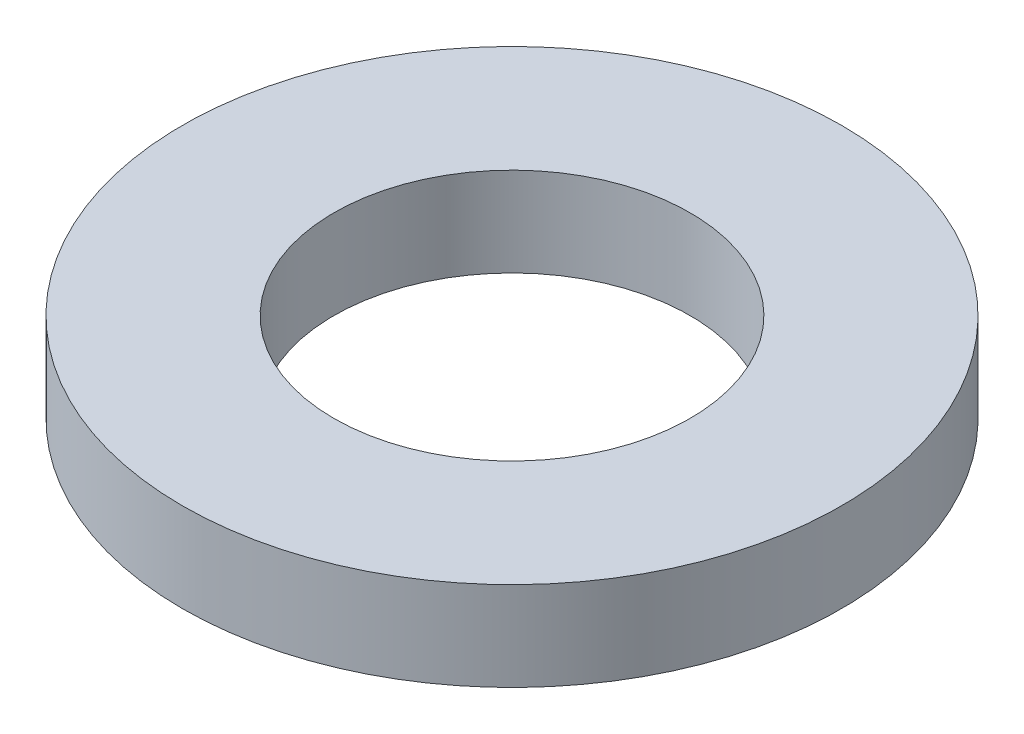
ISO-10303-21;
HEADER;
FILE_DESCRIPTION(('STEP AP214'),'2;1');
FILE_NAME('part.step','',(''),(''),'','','');
FILE_SCHEMA(('AUTOMOTIVE_DESIGN { 1 0 10303 214 1 1 1 1 }'));
ENDSEC;
DATA;
#1=APPLICATION_CONTEXT('core data for automotive mechanical design processes');
#2=APPLICATION_PROTOCOL_DEFINITION('international standard','automotive_design',2000,#1);
#3=PRODUCT_CONTEXT('',#1,'mechanical');
#4=PRODUCT('Part','Part','',(#3));
#5=PRODUCT_RELATED_PRODUCT_CATEGORY('part','',(#4));
#6=PRODUCT_DEFINITION_FORMATION('','',#4);
#7=PRODUCT_DEFINITION_CONTEXT('part definition',#1,'design');
#8=PRODUCT_DEFINITION('design','',#6,#7);
#9=PRODUCT_DEFINITION_SHAPE('','',#8);
#10=(LENGTH_UNIT() NAMED_UNIT(*) SI_UNIT(.MILLI.,.METRE.));
#11=(NAMED_UNIT(*) PLANE_ANGLE_UNIT() SI_UNIT($,.RADIAN.));
#12=(NAMED_UNIT(*) SI_UNIT($,.STERADIAN.) SOLID_ANGLE_UNIT());
#13=UNCERTAINTY_MEASURE_WITH_UNIT(LENGTH_MEASURE(1.E-05),#10,'distance_accuracy_value','');
#14=(GEOMETRIC_REPRESENTATION_CONTEXT(3) GLOBAL_UNCERTAINTY_ASSIGNED_CONTEXT((#13)) GLOBAL_UNIT_ASSIGNED_CONTEXT((#10,
#11,#12)) REPRESENTATION_CONTEXT('',''));
#15=CARTESIAN_POINT('',(0.,0.,0.));
#16=DIRECTION('',(0.,0.,1.));
#17=DIRECTION('',(1.,0.,0.));
#18=AXIS2_PLACEMENT_3D('',#15,#16,#17);
#19=CARTESIAN_POINT('',(0.,25.,0.));
#20=DIRECTION('',(0.,-1.,0.));
#21=DIRECTION('',(0.,0.,-1.));
#22=AXIS2_PLACEMENT_3D('',#19,#20,#21);
#23=CYLINDRICAL_SURFACE('',#22,92.5);
#24=CARTESIAN_POINT('',(0.,25.,0.));
#25=DIRECTION('',(0.,1.,0.));
#26=DIRECTION('',(0.,0.,1.));
#27=AXIS2_PLACEMENT_3D('',#24,#25,#26);
#28=CIRCLE('',#27,92.5);
#29=CARTESIAN_POINT('',(0.,25.,92.5));
#30=VERTEX_POINT('',#29);
#31=EDGE_CURVE('E10',#30,#30,#28,.T.);
#32=ORIENTED_EDGE('',*,*,#31,.F.);
#33=EDGE_LOOP('',(#32));
#34=FACE_BOUND('',#33,.T.);
#35=CARTESIAN_POINT('',(0.,0.,0.));
#36=DIRECTION('',(0.,1.,0.));
#37=DIRECTION('',(0.,0.,1.));
#38=AXIS2_PLACEMENT_3D('',#35,#36,#37);
#39=CIRCLE('',#38,92.5);
#40=CARTESIAN_POINT('',(0.,0.,92.5));
#41=VERTEX_POINT('',#40);
#42=EDGE_CURVE('E37',#41,#41,#39,.T.);
#43=ORIENTED_EDGE('',*,*,#42,.T.);
#44=EDGE_LOOP('',(#43));
#45=FACE_BOUND('',#44,.T.);
#46=ADVANCED_FACE('F40',(#34,#45),#23,.T.);
#47=CARTESIAN_POINT('',(0.,25.,0.));
#48=DIRECTION('',(0.,1.,0.));
#49=DIRECTION('',(0.,0.,1.));
#50=AXIS2_PLACEMENT_3D('',#47,#48,#49);
#51=PLANE('',#50);
#52=CARTESIAN_POINT('',(0.,25.,0.));
#53=DIRECTION('',(0.,1.,0.));
#54=DIRECTION('',(0.,0.,1.));
#55=AXIS2_PLACEMENT_3D('',#52,#53,#54);
#56=CIRCLE('',#55,50.);
#57=CARTESIAN_POINT('',(0.,25.,50.));
#58=VERTEX_POINT('',#57);
#59=EDGE_CURVE('E50',#58,#58,#56,.T.);
#60=ORIENTED_EDGE('',*,*,#59,.F.);
#61=EDGE_LOOP('',(#60));
#62=FACE_BOUND('',#61,.T.);
#63=ORIENTED_EDGE('',*,*,#31,.T.);
#64=EDGE_LOOP('',(#63));
#65=FACE_BOUND('',#64,.T.);
#66=ADVANCED_FACE('F59',(#62,#65),#51,.T.);
#67=CARTESIAN_POINT('',(0.,0.,0.));
#68=DIRECTION('',(0.,1.,0.));
#69=DIRECTION('',(0.,0.,1.));
#70=AXIS2_PLACEMENT_3D('',#67,#68,#69);
#71=PLANE('',#70);
#72=CARTESIAN_POINT('',(0.,0.,0.));
#73=DIRECTION('',(0.,1.,0.));
#74=DIRECTION('',(0.,0.,1.));
#75=AXIS2_PLACEMENT_3D('',#72,#73,#74);
#76=CIRCLE('',#75,50.);
#77=CARTESIAN_POINT('',(0.,0.,50.));
#78=VERTEX_POINT('',#77);
#79=EDGE_CURVE('E47',#78,#78,#76,.T.);
#80=ORIENTED_EDGE('',*,*,#79,.T.);
#81=EDGE_LOOP('',(#80));
#82=FACE_BOUND('',#81,.T.);
#83=ORIENTED_EDGE('',*,*,#42,.F.);
#84=EDGE_LOOP('',(#83));
#85=FACE_BOUND('',#84,.T.);
#86=ADVANCED_FACE('F58',(#82,#85),#71,.F.);
#87=CARTESIAN_POINT('',(0.,25.,0.));
#88=DIRECTION('',(0.,-1.,0.));
#89=DIRECTION('',(0.,0.,-1.));
#90=AXIS2_PLACEMENT_3D('',#87,#88,#89);
#91=CYLINDRICAL_SURFACE('',#90,50.);
#92=ORIENTED_EDGE('',*,*,#59,.T.);
#93=EDGE_LOOP('',(#92));
#94=FACE_BOUND('',#93,.T.);
#95=ORIENTED_EDGE('',*,*,#79,.F.);
#96=EDGE_LOOP('',(#95));
#97=FACE_BOUND('',#96,.T.);
#98=ADVANCED_FACE('F54',(#94,#97),#91,.F.);
#99=CLOSED_SHELL('',(#46,#66,#86,#98));
#100=MANIFOLD_SOLID_BREP('B2',#99);
#101=ADVANCED_BREP_SHAPE_REPRESENTATION('',(#18,#100),#14);
#102=SHAPE_DEFINITION_REPRESENTATION(#9,#101);
ENDSEC;
END-ISO-10303-21;
